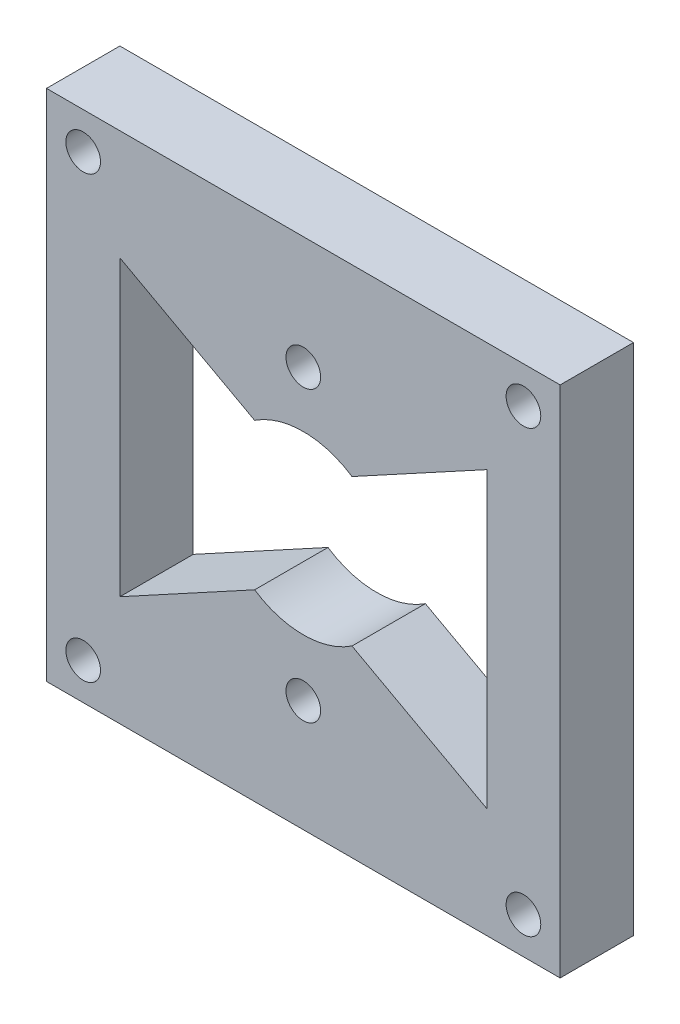
ISO-10303-21;
HEADER;
FILE_DESCRIPTION(('STEP AP214'),'2;1');
FILE_NAME('part.step','',(''),(''),'','','');
FILE_SCHEMA(('AUTOMOTIVE_DESIGN { 1 0 10303 214 1 1 1 1 }'));
ENDSEC;
DATA;
#1=APPLICATION_CONTEXT('core data for automotive mechanical design processes');
#2=APPLICATION_PROTOCOL_DEFINITION('international standard','automotive_design',2000,#1);
#3=PRODUCT_CONTEXT('',#1,'mechanical');
#4=PRODUCT('Part','Part','',(#3));
#5=PRODUCT_RELATED_PRODUCT_CATEGORY('part','',(#4));
#6=PRODUCT_DEFINITION_FORMATION('','',#4);
#7=PRODUCT_DEFINITION_CONTEXT('part definition',#1,'design');
#8=PRODUCT_DEFINITION('design','',#6,#7);
#9=PRODUCT_DEFINITION_SHAPE('','',#8);
#10=(LENGTH_UNIT() NAMED_UNIT(*) SI_UNIT(.MILLI.,.METRE.));
#11=(NAMED_UNIT(*) PLANE_ANGLE_UNIT() SI_UNIT($,.RADIAN.));
#12=(NAMED_UNIT(*) SI_UNIT($,.STERADIAN.) SOLID_ANGLE_UNIT());
#13=UNCERTAINTY_MEASURE_WITH_UNIT(LENGTH_MEASURE(1.E-05),#10,'distance_accuracy_value','');
#14=(GEOMETRIC_REPRESENTATION_CONTEXT(3) GLOBAL_UNCERTAINTY_ASSIGNED_CONTEXT((#13)) GLOBAL_UNIT_ASSIGNED_CONTEXT((#10,
#11,#12)) REPRESENTATION_CONTEXT('',''));
#15=CARTESIAN_POINT('',(0.,0.,0.));
#16=DIRECTION('',(0.,0.,1.));
#17=DIRECTION('',(1.,0.,0.));
#18=AXIS2_PLACEMENT_3D('',#15,#16,#17);
#19=CARTESIAN_POINT('',(22.225,22.225,0.));
#20=DIRECTION('',(0.,0.,1.));
#21=DIRECTION('',(1.,0.,0.));
#22=AXIS2_PLACEMENT_3D('',#19,#20,#21);
#23=CYLINDRICAL_SURFACE('',#22,7.62);
#24=CARTESIAN_POINT('',(22.225,22.225,0.));
#25=DIRECTION('',(0.,0.,1.));
#26=DIRECTION('',(1.,0.,0.));
#27=AXIS2_PLACEMENT_3D('',#24,#25,#26);
#28=CIRCLE('',#27,7.62);
#29=CARTESIAN_POINT('',(18.0128865162486,15.875,0.));
#30=VERTEX_POINT('',#29);
#31=CARTESIAN_POINT('',(26.4371134837514,15.875,0.));
#32=VERTEX_POINT('',#31);
#33=EDGE_CURVE('E56',#30,#32,#28,.T.);
#34=ORIENTED_EDGE('',*,*,#33,.F.);
#35=DIRECTION('',(0.,0.,1.));
#36=VECTOR('',#35,1.);
#37=CARTESIAN_POINT('',(18.0128865162486,15.875,0.));
#38=LINE('',#37,#36);
#39=CARTESIAN_POINT('',(18.0128865162486,15.875,6.35));
#40=VERTEX_POINT('',#39);
#41=EDGE_CURVE('E153',#30,#40,#38,.T.);
#42=ORIENTED_EDGE('',*,*,#41,.T.);
#43=CARTESIAN_POINT('',(22.225,22.225,6.35));
#44=DIRECTION('',(0.,0.,1.));
#45=DIRECTION('',(1.,0.,0.));
#46=AXIS2_PLACEMENT_3D('',#43,#44,#45);
#47=CIRCLE('',#46,7.62);
#48=CARTESIAN_POINT('',(26.4371134837514,15.875,6.35));
#49=VERTEX_POINT('',#48);
#50=EDGE_CURVE('E205',#40,#49,#47,.T.);
#51=ORIENTED_EDGE('',*,*,#50,.T.);
#52=DIRECTION('',(0.,0.,1.));
#53=VECTOR('',#52,1.);
#54=CARTESIAN_POINT('',(26.4371134837514,15.875,0.));
#55=LINE('',#54,#53);
#56=EDGE_CURVE('E179',#32,#49,#55,.T.);
#57=ORIENTED_EDGE('',*,*,#56,.F.);
#58=EDGE_LOOP('',(#34,#42,#51,#57));
#59=FACE_BOUND('',#58,.T.);
#60=ADVANCED_FACE('F33',(#59),#23,.F.);
#61=CARTESIAN_POINT('',(0.,0.,6.35));
#62=DIRECTION('',(1.,0.,0.));
#63=DIRECTION('',(0.,0.,-1.));
#64=AXIS2_PLACEMENT_3D('',#61,#62,#63);
#65=PLANE('',#64);
#66=DIRECTION('',(0.,-1.,0.));
#67=VECTOR('',#66,1.);
#68=CARTESIAN_POINT('',(0.,0.,0.));
#69=LINE('',#68,#67);
#70=CARTESIAN_POINT('',(0.,44.45,0.));
#71=VERTEX_POINT('',#70);
#72=CARTESIAN_POINT('',(0.,0.,0.));
#73=VERTEX_POINT('',#72);
#74=EDGE_CURVE('E222',#71,#73,#69,.T.);
#75=ORIENTED_EDGE('',*,*,#74,.T.);
#76=DIRECTION('',(0.,0.,-1.));
#77=VECTOR('',#76,1.);
#78=CARTESIAN_POINT('',(0.,0.,6.35));
#79=LINE('',#78,#77);
#80=CARTESIAN_POINT('',(0.,0.,6.35));
#81=VERTEX_POINT('',#80);
#82=EDGE_CURVE('E11',#81,#73,#79,.T.);
#83=ORIENTED_EDGE('',*,*,#82,.F.);
#84=DIRECTION('',(0.,-1.,0.));
#85=VECTOR('',#84,1.);
#86=CARTESIAN_POINT('',(0.,0.,6.35));
#87=LINE('',#86,#85);
#88=CARTESIAN_POINT('',(0.,44.45,6.35));
#89=VERTEX_POINT('',#88);
#90=EDGE_CURVE('E225',#89,#81,#87,.T.);
#91=ORIENTED_EDGE('',*,*,#90,.F.);
#92=DIRECTION('',(0.,0.,-1.));
#93=VECTOR('',#92,1.);
#94=CARTESIAN_POINT('',(0.,44.45,6.35));
#95=LINE('',#94,#93);
#96=EDGE_CURVE('E235',#89,#71,#95,.T.);
#97=ORIENTED_EDGE('',*,*,#96,.T.);
#98=EDGE_LOOP('',(#75,#83,#91,#97));
#99=FACE_BOUND('',#98,.T.);
#100=ADVANCED_FACE('F35',(#99),#65,.F.);
#101=CARTESIAN_POINT('',(0.,0.,6.35));
#102=DIRECTION('',(0.,1.,0.));
#103=DIRECTION('',(0.,0.,1.));
#104=AXIS2_PLACEMENT_3D('',#101,#102,#103);
#105=PLANE('',#104);
#106=DIRECTION('',(1.,0.,0.));
#107=VECTOR('',#106,1.);
#108=CARTESIAN_POINT('',(0.,0.,0.));
#109=LINE('',#108,#107);
#110=CARTESIAN_POINT('',(44.45,0.,0.));
#111=VERTEX_POINT('',#110);
#112=EDGE_CURVE('E238',#73,#111,#109,.T.);
#113=ORIENTED_EDGE('',*,*,#112,.T.);
#114=DIRECTION('',(0.,0.,-1.));
#115=VECTOR('',#114,1.);
#116=CARTESIAN_POINT('',(44.45,0.,6.35));
#117=LINE('',#116,#115);
#118=CARTESIAN_POINT('',(44.45,0.,6.35));
#119=VERTEX_POINT('',#118);
#120=EDGE_CURVE('E41',#119,#111,#117,.T.);
#121=ORIENTED_EDGE('',*,*,#120,.F.);
#122=DIRECTION('',(1.,0.,0.));
#123=VECTOR('',#122,1.);
#124=CARTESIAN_POINT('',(0.,0.,6.35));
#125=LINE('',#124,#123);
#126=EDGE_CURVE('E228',#81,#119,#125,.T.);
#127=ORIENTED_EDGE('',*,*,#126,.F.);
#128=ORIENTED_EDGE('',*,*,#82,.T.);
#129=EDGE_LOOP('',(#113,#121,#127,#128));
#130=FACE_BOUND('',#129,.T.);
#131=ADVANCED_FACE('F267',(#130),#105,.F.);
#132=CARTESIAN_POINT('',(44.45,0.,6.35));
#133=DIRECTION('',(-1.,0.,0.));
#134=DIRECTION('',(0.,0.,1.));
#135=AXIS2_PLACEMENT_3D('',#132,#133,#134);
#136=PLANE('',#135);
#137=DIRECTION('',(0.,1.,0.));
#138=VECTOR('',#137,1.);
#139=CARTESIAN_POINT('',(44.45,0.,0.));
#140=LINE('',#139,#138);
#141=CARTESIAN_POINT('',(44.45,44.45,0.));
#142=VERTEX_POINT('',#141);
#143=EDGE_CURVE('E240',#111,#142,#140,.T.);
#144=ORIENTED_EDGE('',*,*,#143,.T.);
#145=DIRECTION('',(0.,0.,-1.));
#146=VECTOR('',#145,1.);
#147=CARTESIAN_POINT('',(44.45,44.45,6.35));
#148=LINE('',#147,#146);
#149=CARTESIAN_POINT('',(44.45,44.45,6.35));
#150=VERTEX_POINT('',#149);
#151=EDGE_CURVE('E245',#150,#142,#148,.T.);
#152=ORIENTED_EDGE('',*,*,#151,.F.);
#153=DIRECTION('',(0.,1.,0.));
#154=VECTOR('',#153,1.);
#155=CARTESIAN_POINT('',(44.45,0.,6.35));
#156=LINE('',#155,#154);
#157=EDGE_CURVE('E231',#119,#150,#156,.T.);
#158=ORIENTED_EDGE('',*,*,#157,.F.);
#159=ORIENTED_EDGE('',*,*,#120,.T.);
#160=EDGE_LOOP('',(#144,#152,#158,#159));
#161=FACE_BOUND('',#160,.T.);
#162=ADVANCED_FACE('F252',(#161),#136,.F.);
#163=CARTESIAN_POINT('',(0.,44.45,6.35));
#164=DIRECTION('',(0.,-1.,0.));
#165=DIRECTION('',(0.,0.,-1.));
#166=AXIS2_PLACEMENT_3D('',#163,#164,#165);
#167=PLANE('',#166);
#168=DIRECTION('',(-1.,0.,0.));
#169=VECTOR('',#168,1.);
#170=CARTESIAN_POINT('',(0.,44.45,0.));
#171=LINE('',#170,#169);
#172=EDGE_CURVE('E229',#142,#71,#171,.T.);
#173=ORIENTED_EDGE('',*,*,#172,.T.);
#174=ORIENTED_EDGE('',*,*,#96,.F.);
#175=DIRECTION('',(-1.,0.,0.));
#176=VECTOR('',#175,1.);
#177=CARTESIAN_POINT('',(0.,44.45,6.35));
#178=LINE('',#177,#176);
#179=EDGE_CURVE('E233',#150,#89,#178,.T.);
#180=ORIENTED_EDGE('',*,*,#179,.F.);
#181=ORIENTED_EDGE('',*,*,#151,.T.);
#182=EDGE_LOOP('',(#173,#174,#180,#181));
#183=FACE_BOUND('',#182,.T.);
#184=ADVANCED_FACE('F260',(#183),#167,.F.);
#185=CARTESIAN_POINT('',(0.,0.,6.35));
#186=DIRECTION('',(0.,0.,-1.));
#187=DIRECTION('',(-1.,0.,0.));
#188=AXIS2_PLACEMENT_3D('',#185,#186,#187);
#189=PLANE('',#188);
#190=CARTESIAN_POINT('',(3.175,3.175,6.35));
#191=DIRECTION('',(0.,0.,1.));
#192=DIRECTION('',(1.,0.,0.));
#193=AXIS2_PLACEMENT_3D('',#190,#191,#192);
#194=CIRCLE('',#193,1.5);
#195=CARTESIAN_POINT('',(4.675,3.175,6.35));
#196=VERTEX_POINT('',#195);
#197=EDGE_CURVE('E176',#196,#196,#194,.T.);
#198=ORIENTED_EDGE('',*,*,#197,.F.);
#199=EDGE_LOOP('',(#198));
#200=FACE_BOUND('',#199,.T.);
#201=CARTESIAN_POINT('',(41.275,3.175,6.35));
#202=DIRECTION('',(0.,0.,1.));
#203=DIRECTION('',(1.,0.,0.));
#204=AXIS2_PLACEMENT_3D('',#201,#202,#203);
#205=CIRCLE('',#204,1.5);
#206=CARTESIAN_POINT('',(42.775,3.175,6.35));
#207=VERTEX_POINT('',#206);
#208=EDGE_CURVE('E187',#207,#207,#205,.T.);
#209=ORIENTED_EDGE('',*,*,#208,.F.);
#210=EDGE_LOOP('',(#209));
#211=FACE_BOUND('',#210,.T.);
#212=CARTESIAN_POINT('',(41.275,41.275,6.35));
#213=DIRECTION('',(0.,0.,1.));
#214=DIRECTION('',(1.,0.,0.));
#215=AXIS2_PLACEMENT_3D('',#212,#213,#214);
#216=CIRCLE('',#215,1.5);
#217=CARTESIAN_POINT('',(42.775,41.275,6.35));
#218=VERTEX_POINT('',#217);
#219=EDGE_CURVE('E193',#218,#218,#216,.T.);
#220=ORIENTED_EDGE('',*,*,#219,.F.);
#221=EDGE_LOOP('',(#220));
#222=FACE_BOUND('',#221,.T.);
#223=CARTESIAN_POINT('',(3.175,41.275,6.35));
#224=DIRECTION('',(0.,0.,1.));
#225=DIRECTION('',(1.,0.,0.));
#226=AXIS2_PLACEMENT_3D('',#223,#224,#225);
#227=CIRCLE('',#226,1.5);
#228=CARTESIAN_POINT('',(4.675,41.275,6.35));
#229=VERTEX_POINT('',#228);
#230=EDGE_CURVE('E199',#229,#229,#227,.T.);
#231=ORIENTED_EDGE('',*,*,#230,.F.);
#232=EDGE_LOOP('',(#231));
#233=FACE_BOUND('',#232,.T.);
#234=ORIENTED_EDGE('',*,*,#50,.F.);
#235=DIRECTION('',(0.878261722315817,0.478180245425149,0.));
#236=VECTOR('',#235,1.);
#237=CARTESIAN_POINT('',(6.34999999999999,9.525,6.35));
#238=LINE('',#237,#236);
#239=CARTESIAN_POINT('',(6.34999999999999,9.525,6.35));
#240=VERTEX_POINT('',#239);
#241=EDGE_CURVE('E145',#240,#40,#238,.T.);
#242=ORIENTED_EDGE('',*,*,#241,.F.);
#243=DIRECTION('',(0.,-1.,0.));
#244=VECTOR('',#243,1.);
#245=CARTESIAN_POINT('',(6.35,34.925,6.35));
#246=LINE('',#245,#244);
#247=CARTESIAN_POINT('',(6.35,34.925,6.35));
#248=VERTEX_POINT('',#247);
#249=EDGE_CURVE('E147',#248,#240,#246,.T.);
#250=ORIENTED_EDGE('',*,*,#249,.F.);
#251=DIRECTION('',(-0.878261722315816,0.478180245425149,0.));
#252=VECTOR('',#251,1.);
#253=CARTESIAN_POINT('',(18.0128865162486,28.575,6.35));
#254=LINE('',#253,#252);
#255=CARTESIAN_POINT('',(18.0128865162486,28.575,6.35));
#256=VERTEX_POINT('',#255);
#257=EDGE_CURVE('E126',#256,#248,#254,.T.);
#258=ORIENTED_EDGE('',*,*,#257,.F.);
#259=CARTESIAN_POINT('',(26.4371134837514,28.575,6.35));
#260=VERTEX_POINT('',#259);
#261=EDGE_CURVE('E210',#260,#256,#47,.T.);
#262=ORIENTED_EDGE('',*,*,#261,.F.);
#263=DIRECTION('',(-0.878261722315816,-0.478180245425149,0.));
#264=VECTOR('',#263,1.);
#265=CARTESIAN_POINT('',(26.4371134837514,28.575,6.35));
#266=LINE('',#265,#264);
#267=CARTESIAN_POINT('',(38.1,34.925,6.35));
#268=VERTEX_POINT('',#267);
#269=EDGE_CURVE('E156',#268,#260,#266,.T.);
#270=ORIENTED_EDGE('',*,*,#269,.F.);
#271=DIRECTION('',(0.,1.,0.));
#272=VECTOR('',#271,1.);
#273=CARTESIAN_POINT('',(38.1,34.925,6.35));
#274=LINE('',#273,#272);
#275=CARTESIAN_POINT('',(38.1,9.525,6.35));
#276=VERTEX_POINT('',#275);
#277=EDGE_CURVE('E162',#276,#268,#274,.T.);
#278=ORIENTED_EDGE('',*,*,#277,.F.);
#279=DIRECTION('',(0.878261722315817,-0.478180245425149,0.));
#280=VECTOR('',#279,1.);
#281=CARTESIAN_POINT('',(38.1,9.525,6.35));
#282=LINE('',#281,#280);
#283=EDGE_CURVE('E169',#49,#276,#282,.T.);
#284=ORIENTED_EDGE('',*,*,#283,.F.);
#285=EDGE_LOOP('',(#234,#242,#250,#258,#262,#270,#278,#284));
#286=FACE_BOUND('',#285,.T.);
#287=CARTESIAN_POINT('',(22.225,9.67099999999999,6.35));
#288=DIRECTION('',(0.,0.,1.));
#289=DIRECTION('',(1.,0.,0.));
#290=AXIS2_PLACEMENT_3D('',#287,#288,#289);
#291=CIRCLE('',#290,1.5);
#292=CARTESIAN_POINT('',(23.725,9.67099999999999,6.35));
#293=VERTEX_POINT('',#292);
#294=EDGE_CURVE('E209',#293,#293,#291,.T.);
#295=ORIENTED_EDGE('',*,*,#294,.F.);
#296=EDGE_LOOP('',(#295));
#297=FACE_BOUND('',#296,.T.);
#298=CARTESIAN_POINT('',(22.225,34.671,6.35));
#299=DIRECTION('',(0.,0.,1.));
#300=DIRECTION('',(1.,0.,0.));
#301=AXIS2_PLACEMENT_3D('',#298,#299,#300);
#302=CIRCLE('',#301,1.5);
#303=CARTESIAN_POINT('',(23.725,34.671,6.35));
#304=VERTEX_POINT('',#303);
#305=EDGE_CURVE('E216',#304,#304,#302,.T.);
#306=ORIENTED_EDGE('',*,*,#305,.F.);
#307=EDGE_LOOP('',(#306));
#308=FACE_BOUND('',#307,.T.);
#309=ORIENTED_EDGE('',*,*,#90,.T.);
#310=ORIENTED_EDGE('',*,*,#126,.T.);
#311=ORIENTED_EDGE('',*,*,#157,.T.);
#312=ORIENTED_EDGE('',*,*,#179,.T.);
#313=EDGE_LOOP('',(#309,#310,#311,#312));
#314=FACE_BOUND('',#313,.T.);
#315=ADVANCED_FACE('F266',(#200,#211,#222,#233,#286,#297,#308,#314),#189,.F.);
#316=CARTESIAN_POINT('',(0.,0.,0.));
#317=DIRECTION('',(0.,0.,-1.));
#318=DIRECTION('',(-1.,0.,0.));
#319=AXIS2_PLACEMENT_3D('',#316,#317,#318);
#320=PLANE('',#319);
#321=DIRECTION('',(0.878261722315817,0.478180245425149,0.));
#322=VECTOR('',#321,1.);
#323=CARTESIAN_POINT('',(6.34999999999999,9.525,0.));
#324=LINE('',#323,#322);
#325=CARTESIAN_POINT('',(6.34999999999999,9.525,0.));
#326=VERTEX_POINT('',#325);
#327=EDGE_CURVE('E137',#326,#30,#324,.T.);
#328=ORIENTED_EDGE('',*,*,#327,.T.);
#329=ORIENTED_EDGE('',*,*,#33,.T.);
#330=DIRECTION('',(0.878261722315817,-0.478180245425149,0.));
#331=VECTOR('',#330,1.);
#332=CARTESIAN_POINT('',(38.1,9.525,0.));
#333=LINE('',#332,#331);
#334=CARTESIAN_POINT('',(38.1,9.525,0.));
#335=VERTEX_POINT('',#334);
#336=EDGE_CURVE('E161',#32,#335,#333,.T.);
#337=ORIENTED_EDGE('',*,*,#336,.T.);
#338=DIRECTION('',(0.,1.,0.));
#339=VECTOR('',#338,1.);
#340=CARTESIAN_POINT('',(38.1,34.925,0.));
#341=LINE('',#340,#339);
#342=CARTESIAN_POINT('',(38.1,34.925,0.));
#343=VERTEX_POINT('',#342);
#344=EDGE_CURVE('E164',#335,#343,#341,.T.);
#345=ORIENTED_EDGE('',*,*,#344,.T.);
#346=DIRECTION('',(-0.878261722315816,-0.478180245425149,0.));
#347=VECTOR('',#346,1.);
#348=CARTESIAN_POINT('',(26.4371134837514,28.575,0.));
#349=LINE('',#348,#347);
#350=CARTESIAN_POINT('',(26.4371134837514,28.575,0.));
#351=VERTEX_POINT('',#350);
#352=EDGE_CURVE('E159',#343,#351,#349,.T.);
#353=ORIENTED_EDGE('',*,*,#352,.T.);
#354=CARTESIAN_POINT('',(18.0128865162486,28.575,0.));
#355=VERTEX_POINT('',#354);
#356=EDGE_CURVE('E144',#351,#355,#28,.T.);
#357=ORIENTED_EDGE('',*,*,#356,.T.);
#358=DIRECTION('',(-0.878261722315816,0.478180245425149,0.));
#359=VECTOR('',#358,1.);
#360=CARTESIAN_POINT('',(18.0128865162486,28.575,0.));
#361=LINE('',#360,#359);
#362=CARTESIAN_POINT('',(6.35,34.925,0.));
#363=VERTEX_POINT('',#362);
#364=EDGE_CURVE('E48',#355,#363,#361,.T.);
#365=ORIENTED_EDGE('',*,*,#364,.T.);
#366=DIRECTION('',(0.,-1.,0.));
#367=VECTOR('',#366,1.);
#368=CARTESIAN_POINT('',(6.35,34.925,0.));
#369=LINE('',#368,#367);
#370=EDGE_CURVE('E134',#363,#326,#369,.T.);
#371=ORIENTED_EDGE('',*,*,#370,.T.);
#372=EDGE_LOOP('',(#328,#329,#337,#345,#353,#357,#365,#371));
#373=FACE_BOUND('',#372,.T.);
#374=CARTESIAN_POINT('',(3.175,3.175,0.));
#375=DIRECTION('',(0.,0.,1.));
#376=DIRECTION('',(1.,0.,0.));
#377=AXIS2_PLACEMENT_3D('',#374,#375,#376);
#378=CIRCLE('',#377,1.5);
#379=CARTESIAN_POINT('',(4.675,3.175,0.));
#380=VERTEX_POINT('',#379);
#381=EDGE_CURVE('E184',#380,#380,#378,.T.);
#382=ORIENTED_EDGE('',*,*,#381,.T.);
#383=EDGE_LOOP('',(#382));
#384=FACE_BOUND('',#383,.T.);
#385=CARTESIAN_POINT('',(41.275,3.175,0.));
#386=DIRECTION('',(0.,0.,1.));
#387=DIRECTION('',(1.,0.,0.));
#388=AXIS2_PLACEMENT_3D('',#385,#386,#387);
#389=CIRCLE('',#388,1.5);
#390=CARTESIAN_POINT('',(42.775,3.175,0.));
#391=VERTEX_POINT('',#390);
#392=EDGE_CURVE('E190',#391,#391,#389,.T.);
#393=ORIENTED_EDGE('',*,*,#392,.T.);
#394=EDGE_LOOP('',(#393));
#395=FACE_BOUND('',#394,.T.);
#396=CARTESIAN_POINT('',(41.275,41.275,0.));
#397=DIRECTION('',(0.,0.,1.));
#398=DIRECTION('',(1.,0.,0.));
#399=AXIS2_PLACEMENT_3D('',#396,#397,#398);
#400=CIRCLE('',#399,1.5);
#401=CARTESIAN_POINT('',(42.775,41.275,0.));
#402=VERTEX_POINT('',#401);
#403=EDGE_CURVE('E196',#402,#402,#400,.T.);
#404=ORIENTED_EDGE('',*,*,#403,.T.);
#405=EDGE_LOOP('',(#404));
#406=FACE_BOUND('',#405,.T.);
#407=CARTESIAN_POINT('',(3.175,41.275,0.));
#408=DIRECTION('',(0.,0.,1.));
#409=DIRECTION('',(1.,0.,0.));
#410=AXIS2_PLACEMENT_3D('',#407,#408,#409);
#411=CIRCLE('',#410,1.5);
#412=CARTESIAN_POINT('',(4.675,41.275,0.));
#413=VERTEX_POINT('',#412);
#414=EDGE_CURVE('E202',#413,#413,#411,.T.);
#415=ORIENTED_EDGE('',*,*,#414,.T.);
#416=EDGE_LOOP('',(#415));
#417=FACE_BOUND('',#416,.T.);
#418=CARTESIAN_POINT('',(22.225,9.67099999999999,0.));
#419=DIRECTION('',(0.,0.,1.));
#420=DIRECTION('',(1.,0.,0.));
#421=AXIS2_PLACEMENT_3D('',#418,#419,#420);
#422=CIRCLE('',#421,1.5);
#423=CARTESIAN_POINT('',(23.725,9.67099999999999,0.));
#424=VERTEX_POINT('',#423);
#425=EDGE_CURVE('E213',#424,#424,#422,.T.);
#426=ORIENTED_EDGE('',*,*,#425,.T.);
#427=EDGE_LOOP('',(#426));
#428=FACE_BOUND('',#427,.T.);
#429=CARTESIAN_POINT('',(22.225,34.671,0.));
#430=DIRECTION('',(0.,0.,1.));
#431=DIRECTION('',(1.,0.,0.));
#432=AXIS2_PLACEMENT_3D('',#429,#430,#431);
#433=CIRCLE('',#432,1.5);
#434=CARTESIAN_POINT('',(23.725,34.671,0.));
#435=VERTEX_POINT('',#434);
#436=EDGE_CURVE('E219',#435,#435,#433,.T.);
#437=ORIENTED_EDGE('',*,*,#436,.T.);
#438=EDGE_LOOP('',(#437));
#439=FACE_BOUND('',#438,.T.);
#440=ORIENTED_EDGE('',*,*,#74,.F.);
#441=ORIENTED_EDGE('',*,*,#172,.F.);
#442=ORIENTED_EDGE('',*,*,#143,.F.);
#443=ORIENTED_EDGE('',*,*,#112,.F.);
#444=EDGE_LOOP('',(#440,#441,#442,#443));
#445=FACE_BOUND('',#444,.T.);
#446=ADVANCED_FACE('F140',(#373,#384,#395,#406,#417,#428,#439,#445),#320,.T.);
#447=CARTESIAN_POINT('',(22.225,34.671,0.));
#448=DIRECTION('',(0.,0.,1.));
#449=DIRECTION('',(1.,0.,0.));
#450=AXIS2_PLACEMENT_3D('',#447,#448,#449);
#451=CYLINDRICAL_SURFACE('',#450,1.5);
#452=ORIENTED_EDGE('',*,*,#436,.F.);
#453=EDGE_LOOP('',(#452));
#454=FACE_BOUND('',#453,.T.);
#455=ORIENTED_EDGE('',*,*,#305,.T.);
#456=EDGE_LOOP('',(#455));
#457=FACE_BOUND('',#456,.T.);
#458=ADVANCED_FACE('F292',(#454,#457),#451,.F.);
#459=CARTESIAN_POINT('',(22.225,9.67099999999999,0.));
#460=DIRECTION('',(0.,0.,1.));
#461=DIRECTION('',(1.,0.,0.));
#462=AXIS2_PLACEMENT_3D('',#459,#460,#461);
#463=CYLINDRICAL_SURFACE('',#462,1.5);
#464=ORIENTED_EDGE('',*,*,#425,.F.);
#465=EDGE_LOOP('',(#464));
#466=FACE_BOUND('',#465,.T.);
#467=ORIENTED_EDGE('',*,*,#294,.T.);
#468=EDGE_LOOP('',(#467));
#469=FACE_BOUND('',#468,.T.);
#470=ADVANCED_FACE('F284',(#466,#469),#463,.F.);
#471=ORIENTED_EDGE('',*,*,#261,.T.);
#472=DIRECTION('',(0.,0.,1.));
#473=VECTOR('',#472,1.);
#474=CARTESIAN_POINT('',(18.0128865162486,28.575,0.));
#475=LINE('',#474,#473);
#476=EDGE_CURVE('E131',#355,#256,#475,.T.);
#477=ORIENTED_EDGE('',*,*,#476,.F.);
#478=ORIENTED_EDGE('',*,*,#356,.F.);
#479=DIRECTION('',(0.,0.,1.));
#480=VECTOR('',#479,1.);
#481=CARTESIAN_POINT('',(26.4371134837514,28.575,0.));
#482=LINE('',#481,#480);
#483=EDGE_CURVE('E167',#351,#260,#482,.T.);
#484=ORIENTED_EDGE('',*,*,#483,.T.);
#485=EDGE_LOOP('',(#471,#477,#478,#484));
#486=FACE_BOUND('',#485,.T.);
#487=ADVANCED_FACE('F277',(#486),#23,.F.);
#488=CARTESIAN_POINT('',(3.175,41.275,0.));
#489=DIRECTION('',(0.,0.,1.));
#490=DIRECTION('',(1.,0.,0.));
#491=AXIS2_PLACEMENT_3D('',#488,#489,#490);
#492=CYLINDRICAL_SURFACE('',#491,1.5);
#493=ORIENTED_EDGE('',*,*,#414,.F.);
#494=EDGE_LOOP('',(#493));
#495=FACE_BOUND('',#494,.T.);
#496=ORIENTED_EDGE('',*,*,#230,.T.);
#497=EDGE_LOOP('',(#496));
#498=FACE_BOUND('',#497,.T.);
#499=ADVANCED_FACE('F283',(#495,#498),#492,.F.);
#500=CARTESIAN_POINT('',(41.275,41.275,0.));
#501=DIRECTION('',(0.,0.,1.));
#502=DIRECTION('',(1.,0.,0.));
#503=AXIS2_PLACEMENT_3D('',#500,#501,#502);
#504=CYLINDRICAL_SURFACE('',#503,1.5);
#505=ORIENTED_EDGE('',*,*,#403,.F.);
#506=EDGE_LOOP('',(#505));
#507=FACE_BOUND('',#506,.T.);
#508=ORIENTED_EDGE('',*,*,#219,.T.);
#509=EDGE_LOOP('',(#508));
#510=FACE_BOUND('',#509,.T.);
#511=ADVANCED_FACE('F290',(#507,#510),#504,.F.);
#512=CARTESIAN_POINT('',(41.275,3.175,0.));
#513=DIRECTION('',(0.,0.,1.));
#514=DIRECTION('',(1.,0.,0.));
#515=AXIS2_PLACEMENT_3D('',#512,#513,#514);
#516=CYLINDRICAL_SURFACE('',#515,1.5);
#517=ORIENTED_EDGE('',*,*,#392,.F.);
#518=EDGE_LOOP('',(#517));
#519=FACE_BOUND('',#518,.T.);
#520=ORIENTED_EDGE('',*,*,#208,.T.);
#521=EDGE_LOOP('',(#520));
#522=FACE_BOUND('',#521,.T.);
#523=ADVANCED_FACE('F321',(#519,#522),#516,.F.);
#524=CARTESIAN_POINT('',(3.175,3.175,0.));
#525=DIRECTION('',(0.,0.,1.));
#526=DIRECTION('',(1.,0.,0.));
#527=AXIS2_PLACEMENT_3D('',#524,#525,#526);
#528=CYLINDRICAL_SURFACE('',#527,1.5);
#529=ORIENTED_EDGE('',*,*,#381,.F.);
#530=EDGE_LOOP('',(#529));
#531=FACE_BOUND('',#530,.T.);
#532=ORIENTED_EDGE('',*,*,#197,.T.);
#533=EDGE_LOOP('',(#532));
#534=FACE_BOUND('',#533,.T.);
#535=ADVANCED_FACE('F314',(#531,#534),#528,.F.);
#536=CARTESIAN_POINT('',(26.4371134837514,28.575,0.));
#537=DIRECTION('',(-0.478180245425149,0.878261722315816,0.));
#538=DIRECTION('',(-0.878261722315817,-0.478180245425149,0.));
#539=AXIS2_PLACEMENT_3D('',#536,#537,#538);
#540=PLANE('',#539);
#541=ORIENTED_EDGE('',*,*,#269,.T.);
#542=ORIENTED_EDGE('',*,*,#483,.F.);
#543=ORIENTED_EDGE('',*,*,#352,.F.);
#544=DIRECTION('',(0.,0.,1.));
#545=VECTOR('',#544,1.);
#546=CARTESIAN_POINT('',(38.1,34.925,0.));
#547=LINE('',#546,#545);
#548=EDGE_CURVE('E174',#343,#268,#547,.T.);
#549=ORIENTED_EDGE('',*,*,#548,.T.);
#550=EDGE_LOOP('',(#541,#542,#543,#549));
#551=FACE_BOUND('',#550,.T.);
#552=ADVANCED_FACE('F312',(#551),#540,.F.);
#553=CARTESIAN_POINT('',(38.1,34.925,0.));
#554=DIRECTION('',(1.,0.,0.));
#555=DIRECTION('',(0.,1.,0.));
#556=AXIS2_PLACEMENT_3D('',#553,#554,#555);
#557=PLANE('',#556);
#558=ORIENTED_EDGE('',*,*,#277,.T.);
#559=ORIENTED_EDGE('',*,*,#548,.F.);
#560=ORIENTED_EDGE('',*,*,#344,.F.);
#561=DIRECTION('',(0.,0.,1.));
#562=VECTOR('',#561,1.);
#563=CARTESIAN_POINT('',(38.1,9.525,0.));
#564=LINE('',#563,#562);
#565=EDGE_CURVE('E177',#335,#276,#564,.T.);
#566=ORIENTED_EDGE('',*,*,#565,.T.);
#567=EDGE_LOOP('',(#558,#559,#560,#566));
#568=FACE_BOUND('',#567,.T.);
#569=ADVANCED_FACE('F308',(#568),#557,.F.);
#570=CARTESIAN_POINT('',(38.1,9.525,0.));
#571=DIRECTION('',(-0.478180245425149,-0.878261722315817,0.));
#572=DIRECTION('',(0.878261722315817,-0.478180245425149,0.));
#573=AXIS2_PLACEMENT_3D('',#570,#571,#572);
#574=PLANE('',#573);
#575=ORIENTED_EDGE('',*,*,#283,.T.);
#576=ORIENTED_EDGE('',*,*,#565,.F.);
#577=ORIENTED_EDGE('',*,*,#336,.F.);
#578=ORIENTED_EDGE('',*,*,#56,.T.);
#579=EDGE_LOOP('',(#575,#576,#577,#578));
#580=FACE_BOUND('',#579,.T.);
#581=ADVANCED_FACE('F306',(#580),#574,.F.);
#582=CARTESIAN_POINT('',(6.34999999999999,9.525,0.));
#583=DIRECTION('',(0.478180245425149,-0.878261722315817,0.));
#584=DIRECTION('',(0.878261722315817,0.478180245425149,0.));
#585=AXIS2_PLACEMENT_3D('',#582,#583,#584);
#586=PLANE('',#585);
#587=ORIENTED_EDGE('',*,*,#241,.T.);
#588=ORIENTED_EDGE('',*,*,#41,.F.);
#589=ORIENTED_EDGE('',*,*,#327,.F.);
#590=DIRECTION('',(0.,0.,1.));
#591=VECTOR('',#590,1.);
#592=CARTESIAN_POINT('',(6.34999999999999,9.525,0.));
#593=LINE('',#592,#591);
#594=EDGE_CURVE('E130',#326,#240,#593,.T.);
#595=ORIENTED_EDGE('',*,*,#594,.T.);
#596=EDGE_LOOP('',(#587,#588,#589,#595));
#597=FACE_BOUND('',#596,.T.);
#598=ADVANCED_FACE('F303',(#597),#586,.F.);
#599=CARTESIAN_POINT('',(6.35,34.925,0.));
#600=DIRECTION('',(-1.,0.,0.));
#601=DIRECTION('',(0.,-1.,0.));
#602=AXIS2_PLACEMENT_3D('',#599,#600,#601);
#603=PLANE('',#602);
#604=ORIENTED_EDGE('',*,*,#249,.T.);
#605=ORIENTED_EDGE('',*,*,#594,.F.);
#606=ORIENTED_EDGE('',*,*,#370,.F.);
#607=DIRECTION('',(0.,0.,1.));
#608=VECTOR('',#607,1.);
#609=CARTESIAN_POINT('',(6.35,34.925,0.));
#610=LINE('',#609,#608);
#611=EDGE_CURVE('E122',#363,#248,#610,.T.);
#612=ORIENTED_EDGE('',*,*,#611,.T.);
#613=EDGE_LOOP('',(#604,#605,#606,#612));
#614=FACE_BOUND('',#613,.T.);
#615=ADVANCED_FACE('F135',(#614),#603,.F.);
#616=CARTESIAN_POINT('',(18.0128865162486,28.575,0.));
#617=DIRECTION('',(0.478180245425149,0.878261722315816,0.));
#618=DIRECTION('',(-0.878261722315817,0.478180245425149,0.));
#619=AXIS2_PLACEMENT_3D('',#616,#617,#618);
#620=PLANE('',#619);
#621=ORIENTED_EDGE('',*,*,#257,.T.);
#622=ORIENTED_EDGE('',*,*,#611,.F.);
#623=ORIENTED_EDGE('',*,*,#364,.F.);
#624=ORIENTED_EDGE('',*,*,#476,.T.);
#625=EDGE_LOOP('',(#621,#622,#623,#624));
#626=FACE_BOUND('',#625,.T.);
#627=ADVANCED_FACE('F124',(#626),#620,.F.);
#628=CLOSED_SHELL('',(#60,#100,#131,#162,#184,#315,#446,#458,#470,#487,#499,#511,#523,#535,#552,
#569,#581,#598,#615,#627));
#629=MANIFOLD_SOLID_BREP('B2',#628);
#630=ADVANCED_BREP_SHAPE_REPRESENTATION('',(#18,#629),#14);
#631=SHAPE_DEFINITION_REPRESENTATION(#9,#630);
ENDSEC;
END-ISO-10303-21;
